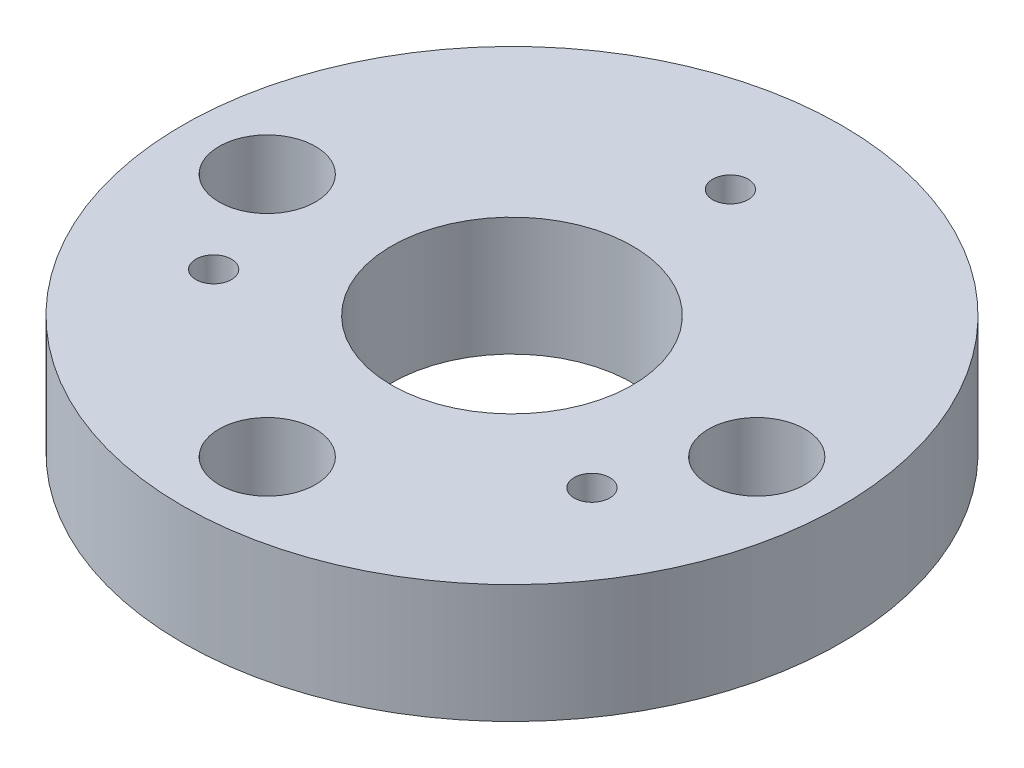
ISO-10303-21;
HEADER;
FILE_DESCRIPTION(('STEP AP214'),'2;1');
FILE_NAME('part.step','',(''),(''),'','','');
FILE_SCHEMA(('AUTOMOTIVE_DESIGN { 1 0 10303 214 1 1 1 1 }'));
ENDSEC;
DATA;
#1=APPLICATION_CONTEXT('core data for automotive mechanical design processes');
#2=APPLICATION_PROTOCOL_DEFINITION('international standard','automotive_design',2000,#1);
#3=PRODUCT_CONTEXT('',#1,'mechanical');
#4=PRODUCT('Part','Part','',(#3));
#5=PRODUCT_RELATED_PRODUCT_CATEGORY('part','',(#4));
#6=PRODUCT_DEFINITION_FORMATION('','',#4);
#7=PRODUCT_DEFINITION_CONTEXT('part definition',#1,'design');
#8=PRODUCT_DEFINITION('design','',#6,#7);
#9=PRODUCT_DEFINITION_SHAPE('','',#8);
#10=(LENGTH_UNIT() NAMED_UNIT(*) SI_UNIT(.MILLI.,.METRE.));
#11=(NAMED_UNIT(*) PLANE_ANGLE_UNIT() SI_UNIT($,.RADIAN.));
#12=(NAMED_UNIT(*) SI_UNIT($,.STERADIAN.) SOLID_ANGLE_UNIT());
#13=UNCERTAINTY_MEASURE_WITH_UNIT(LENGTH_MEASURE(1.E-05),#10,'distance_accuracy_value','');
#14=(GEOMETRIC_REPRESENTATION_CONTEXT(3) GLOBAL_UNCERTAINTY_ASSIGNED_CONTEXT((#13)) GLOBAL_UNIT_ASSIGNED_CONTEXT((#10,
#11,#12)) REPRESENTATION_CONTEXT('',''));
#15=CARTESIAN_POINT('',(0.,0.,0.));
#16=DIRECTION('',(0.,0.,1.));
#17=DIRECTION('',(1.,0.,0.));
#18=AXIS2_PLACEMENT_3D('',#15,#16,#17);
#19=CARTESIAN_POINT('',(20.6375,0.,0.));
#20=DIRECTION('',(0.,1.,0.));
#21=DIRECTION('',(0.,0.,1.));
#22=AXIS2_PLACEMENT_3D('',#19,#20,#21);
#23=CYLINDRICAL_SURFACE('',#22,1.83872486259726);
#24=CARTESIAN_POINT('',(20.6375,0.,0.));
#25=DIRECTION('',(0.,1.,0.));
#26=DIRECTION('',(0.,0.,1.));
#27=AXIS2_PLACEMENT_3D('',#24,#25,#26);
#28=CIRCLE('',#27,1.83872486259726);
#29=CARTESIAN_POINT('',(20.6375,0.,1.83872486259726));
#30=VERTEX_POINT('',#29);
#31=EDGE_CURVE('E80',#30,#30,#28,.T.);
#32=ORIENTED_EDGE('',*,*,#31,.F.);
#33=EDGE_LOOP('',(#32));
#34=FACE_BOUND('',#33,.T.);
#35=CARTESIAN_POINT('',(20.6375,4.,0.));
#36=DIRECTION('',(0.,1.,0.));
#37=DIRECTION('',(0.,0.,1.));
#38=AXIS2_PLACEMENT_3D('',#35,#36,#37);
#39=CIRCLE('',#38,1.83872486259726);
#40=CARTESIAN_POINT('',(20.6375,4.,1.83872486259726));
#41=VERTEX_POINT('',#40);
#42=EDGE_CURVE('E35',#41,#41,#39,.F.);
#43=ORIENTED_EDGE('',*,*,#42,.F.);
#44=EDGE_LOOP('',(#43));
#45=FACE_BOUND('',#44,.T.);
#46=ADVANCED_FACE('F31',(#34,#45),#23,.F.);
#47=CARTESIAN_POINT('',(0.,0.,20.6375));
#48=DIRECTION('',(0.,1.,0.));
#49=DIRECTION('',(0.,0.,1.));
#50=AXIS2_PLACEMENT_3D('',#47,#48,#49);
#51=CYLINDRICAL_SURFACE('',#50,1.83872486259726);
#52=CARTESIAN_POINT('',(0.,0.,20.6375));
#53=DIRECTION('',(0.,1.,0.));
#54=DIRECTION('',(0.,0.,1.));
#55=AXIS2_PLACEMENT_3D('',#52,#53,#54);
#56=CIRCLE('',#55,1.83872486259726);
#57=CARTESIAN_POINT('',(0.,0.,22.4762248625973));
#58=VERTEX_POINT('',#57);
#59=EDGE_CURVE('E77',#58,#58,#56,.T.);
#60=ORIENTED_EDGE('',*,*,#59,.F.);
#61=EDGE_LOOP('',(#60));
#62=FACE_BOUND('',#61,.T.);
#63=CARTESIAN_POINT('',(0.,4.,20.6375));
#64=DIRECTION('',(0.,1.,0.));
#65=DIRECTION('',(0.,0.,1.));
#66=AXIS2_PLACEMENT_3D('',#63,#64,#65);
#67=CIRCLE('',#66,1.83872486259726);
#68=CARTESIAN_POINT('',(0.,4.,22.4762248625973));
#69=VERTEX_POINT('',#68);
#70=EDGE_CURVE('E52',#69,#69,#67,.F.);
#71=ORIENTED_EDGE('',*,*,#70,.F.);
#72=EDGE_LOOP('',(#71));
#73=FACE_BOUND('',#72,.T.);
#74=ADVANCED_FACE('F157',(#62,#73),#51,.F.);
#75=CARTESIAN_POINT('',(-20.6375,0.,0.));
#76=DIRECTION('',(0.,1.,0.));
#77=DIRECTION('',(0.,0.,1.));
#78=AXIS2_PLACEMENT_3D('',#75,#76,#77);
#79=CYLINDRICAL_SURFACE('',#78,1.83872486259726);
#80=CARTESIAN_POINT('',(-20.6375,0.,0.));
#81=DIRECTION('',(0.,1.,0.));
#82=DIRECTION('',(0.,0.,1.));
#83=AXIS2_PLACEMENT_3D('',#80,#81,#82);
#84=CIRCLE('',#83,1.83872486259726);
#85=CARTESIAN_POINT('',(-20.6375,0.,1.83872486259726));
#86=VERTEX_POINT('',#85);
#87=EDGE_CURVE('E50',#86,#86,#84,.T.);
#88=ORIENTED_EDGE('',*,*,#87,.F.);
#89=EDGE_LOOP('',(#88));
#90=FACE_BOUND('',#89,.T.);
#91=CARTESIAN_POINT('',(-20.6375,4.,0.));
#92=DIRECTION('',(0.,1.,0.));
#93=DIRECTION('',(0.,0.,1.));
#94=AXIS2_PLACEMENT_3D('',#91,#92,#93);
#95=CIRCLE('',#94,1.83872486259726);
#96=CARTESIAN_POINT('',(-20.6375,4.,1.83872486259726));
#97=VERTEX_POINT('',#96);
#98=EDGE_CURVE('E48',#97,#97,#95,.F.);
#99=ORIENTED_EDGE('',*,*,#98,.F.);
#100=EDGE_LOOP('',(#99));
#101=FACE_BOUND('',#100,.T.);
#102=ADVANCED_FACE('F163',(#90,#101),#79,.F.);
#103=CARTESIAN_POINT('',(0.,10.,0.));
#104=DIRECTION('',(0.,1.,0.));
#105=DIRECTION('',(0.,0.,1.));
#106=AXIS2_PLACEMENT_3D('',#103,#104,#105);
#107=PLANE('',#106);
#108=CARTESIAN_POINT('',(0.,10.,20.6375));
#109=DIRECTION('',(0.,1.,0.));
#110=DIRECTION('',(0.,0.,1.));
#111=AXIS2_PLACEMENT_3D('',#108,#109,#110);
#112=CIRCLE('',#111,4.064);
#113=CARTESIAN_POINT('',(0.,10.,24.7015));
#114=VERTEX_POINT('',#113);
#115=EDGE_CURVE('E60',#114,#114,#112,.T.);
#116=ORIENTED_EDGE('',*,*,#115,.F.);
#117=EDGE_LOOP('',(#116));
#118=FACE_BOUND('',#117,.T.);
#119=CARTESIAN_POINT('',(20.6375,10.,0.));
#120=DIRECTION('',(0.,1.,0.));
#121=DIRECTION('',(0.,0.,1.));
#122=AXIS2_PLACEMENT_3D('',#119,#120,#121);
#123=CIRCLE('',#122,4.064);
#124=CARTESIAN_POINT('',(20.6375,10.,4.064));
#125=VERTEX_POINT('',#124);
#126=EDGE_CURVE('E70',#125,#125,#123,.T.);
#127=ORIENTED_EDGE('',*,*,#126,.F.);
#128=EDGE_LOOP('',(#127));
#129=FACE_BOUND('',#128,.T.);
#130=CARTESIAN_POINT('',(-20.6375,10.,0.));
#131=DIRECTION('',(0.,1.,0.));
#132=DIRECTION('',(0.,0.,1.));
#133=AXIS2_PLACEMENT_3D('',#130,#131,#132);
#134=CIRCLE('',#133,4.064);
#135=CARTESIAN_POINT('',(-20.6375,10.,4.064));
#136=VERTEX_POINT('',#135);
#137=EDGE_CURVE('E58',#136,#136,#134,.T.);
#138=ORIENTED_EDGE('',*,*,#137,.F.);
#139=EDGE_LOOP('',(#138));
#140=FACE_BOUND('',#139,.T.);
#141=CARTESIAN_POINT('',(15.9478578106922,10.,9.20750000000042));
#142=DIRECTION('',(0.,1.,0.));
#143=DIRECTION('',(0.,0.,1.));
#144=AXIS2_PLACEMENT_3D('',#141,#142,#143);
#145=CIRCLE('',#144,1.5);
#146=CARTESIAN_POINT('',(15.9478578106922,10.,10.7075000000004));
#147=VERTEX_POINT('',#146);
#148=EDGE_CURVE('E86',#147,#147,#145,.T.);
#149=ORIENTED_EDGE('',*,*,#148,.F.);
#150=EDGE_LOOP('',(#149));
#151=FACE_BOUND('',#150,.T.);
#152=CARTESIAN_POINT('',(-15.9478578106887,10.,9.20749999999958));
#153=DIRECTION('',(0.,1.,0.));
#154=DIRECTION('',(0.,0.,1.));
#155=AXIS2_PLACEMENT_3D('',#152,#153,#154);
#156=CIRCLE('',#155,1.5);
#157=CARTESIAN_POINT('',(-15.9478578106887,10.,10.7074999999996));
#158=VERTEX_POINT('',#157);
#159=EDGE_CURVE('E85',#158,#158,#156,.T.);
#160=ORIENTED_EDGE('',*,*,#159,.F.);
#161=EDGE_LOOP('',(#160));
#162=FACE_BOUND('',#161,.T.);
#163=CARTESIAN_POINT('',(2.51206143219242E-12,10.,-18.415));
#164=DIRECTION('',(0.,1.,0.));
#165=DIRECTION('',(0.,0.,1.));
#166=AXIS2_PLACEMENT_3D('',#163,#164,#165);
#167=CIRCLE('',#166,1.5);
#168=CARTESIAN_POINT('',(2.51206143219242E-12,10.,-16.915));
#169=VERTEX_POINT('',#168);
#170=EDGE_CURVE('E89',#169,#169,#167,.T.);
#171=ORIENTED_EDGE('',*,*,#170,.F.);
#172=EDGE_LOOP('',(#171));
#173=FACE_BOUND('',#172,.T.);
#174=CARTESIAN_POINT('',(0.,10.,0.));
#175=DIRECTION('',(0.,1.,0.));
#176=DIRECTION('',(0.,0.,1.));
#177=AXIS2_PLACEMENT_3D('',#174,#175,#176);
#178=CIRCLE('',#177,27.7876);
#179=CARTESIAN_POINT('',(0.,10.,27.7876));
#180=VERTEX_POINT('',#179);
#181=EDGE_CURVE('E101',#180,#180,#178,.T.);
#182=ORIENTED_EDGE('',*,*,#181,.T.);
#183=EDGE_LOOP('',(#182));
#184=FACE_BOUND('',#183,.T.);
#185=CARTESIAN_POINT('',(0.,10.,0.));
#186=DIRECTION('',(0.,1.,0.));
#187=DIRECTION('',(0.,0.,1.));
#188=AXIS2_PLACEMENT_3D('',#185,#186,#187);
#189=CIRCLE('',#188,10.16);
#190=CARTESIAN_POINT('',(0.,10.,10.16));
#191=VERTEX_POINT('',#190);
#192=EDGE_CURVE('E95',#191,#191,#189,.T.);
#193=ORIENTED_EDGE('',*,*,#192,.F.);
#194=EDGE_LOOP('',(#193));
#195=FACE_BOUND('',#194,.T.);
#196=ADVANCED_FACE('F132',(#118,#129,#140,#151,#162,#173,#184,#195),#107,.T.);
#197=CARTESIAN_POINT('',(0.,0.,0.));
#198=DIRECTION('',(0.,1.,0.));
#199=DIRECTION('',(0.,0.,1.));
#200=AXIS2_PLACEMENT_3D('',#197,#198,#199);
#201=PLANE('',#200);
#202=ORIENTED_EDGE('',*,*,#59,.T.);
#203=EDGE_LOOP('',(#202));
#204=FACE_BOUND('',#203,.T.);
#205=ORIENTED_EDGE('',*,*,#87,.T.);
#206=EDGE_LOOP('',(#205));
#207=FACE_BOUND('',#206,.T.);
#208=ORIENTED_EDGE('',*,*,#31,.T.);
#209=EDGE_LOOP('',(#208));
#210=FACE_BOUND('',#209,.T.);
#211=CARTESIAN_POINT('',(-15.9478578106887,0.,9.20749999999958));
#212=DIRECTION('',(0.,1.,0.));
#213=DIRECTION('',(0.,0.,1.));
#214=AXIS2_PLACEMENT_3D('',#211,#212,#213);
#215=CIRCLE('',#214,3.89999999999998);
#216=CARTESIAN_POINT('',(-15.9478578106887,0.,13.1074999999996));
#217=VERTEX_POINT('',#216);
#218=EDGE_CURVE('E112',#217,#217,#215,.T.);
#219=ORIENTED_EDGE('',*,*,#218,.T.);
#220=EDGE_LOOP('',(#219));
#221=FACE_BOUND('',#220,.T.);
#222=CARTESIAN_POINT('',(15.9478578106922,0.,9.20750000000042));
#223=DIRECTION('',(0.,1.,0.));
#224=DIRECTION('',(0.,0.,1.));
#225=AXIS2_PLACEMENT_3D('',#222,#223,#224);
#226=CIRCLE('',#225,3.9);
#227=CARTESIAN_POINT('',(15.9478578106922,0.,13.1075000000004));
#228=VERTEX_POINT('',#227);
#229=EDGE_CURVE('E109',#228,#228,#226,.T.);
#230=ORIENTED_EDGE('',*,*,#229,.T.);
#231=EDGE_LOOP('',(#230));
#232=FACE_BOUND('',#231,.T.);
#233=CARTESIAN_POINT('',(2.51206143219242E-12,0.,-18.415));
#234=DIRECTION('',(0.,1.,0.));
#235=DIRECTION('',(0.,0.,1.));
#236=AXIS2_PLACEMENT_3D('',#233,#234,#235);
#237=CIRCLE('',#236,3.9);
#238=CARTESIAN_POINT('',(2.51206143219242E-12,0.,-14.515));
#239=VERTEX_POINT('',#238);
#240=EDGE_CURVE('E104',#239,#239,#237,.T.);
#241=ORIENTED_EDGE('',*,*,#240,.T.);
#242=EDGE_LOOP('',(#241));
#243=FACE_BOUND('',#242,.T.);
#244=CARTESIAN_POINT('',(0.,0.,0.));
#245=DIRECTION('',(0.,1.,0.));
#246=DIRECTION('',(0.,0.,1.));
#247=AXIS2_PLACEMENT_3D('',#244,#245,#246);
#248=CIRCLE('',#247,27.7876);
#249=CARTESIAN_POINT('',(0.,0.,27.7876));
#250=VERTEX_POINT('',#249);
#251=EDGE_CURVE('E98',#250,#250,#248,.T.);
#252=ORIENTED_EDGE('',*,*,#251,.F.);
#253=EDGE_LOOP('',(#252));
#254=FACE_BOUND('',#253,.T.);
#255=CARTESIAN_POINT('',(0.,0.,0.));
#256=DIRECTION('',(0.,1.,0.));
#257=DIRECTION('',(0.,0.,1.));
#258=AXIS2_PLACEMENT_3D('',#255,#256,#257);
#259=CIRCLE('',#258,10.16);
#260=CARTESIAN_POINT('',(0.,0.,10.16));
#261=VERTEX_POINT('',#260);
#262=EDGE_CURVE('E94',#261,#261,#259,.T.);
#263=ORIENTED_EDGE('',*,*,#262,.T.);
#264=EDGE_LOOP('',(#263));
#265=FACE_BOUND('',#264,.T.);
#266=ADVANCED_FACE('F128',(#204,#207,#210,#221,#232,#243,#254,#265),#201,.F.);
#267=CARTESIAN_POINT('',(0.,10.,0.));
#268=DIRECTION('',(0.,-1.,0.));
#269=DIRECTION('',(0.,0.,-1.));
#270=AXIS2_PLACEMENT_3D('',#267,#268,#269);
#271=CYLINDRICAL_SURFACE('',#270,27.7876);
#272=ORIENTED_EDGE('',*,*,#181,.F.);
#273=EDGE_LOOP('',(#272));
#274=FACE_BOUND('',#273,.T.);
#275=ORIENTED_EDGE('',*,*,#251,.T.);
#276=EDGE_LOOP('',(#275));
#277=FACE_BOUND('',#276,.T.);
#278=ADVANCED_FACE('F131',(#274,#277),#271,.T.);
#279=CARTESIAN_POINT('',(0.,10.,0.));
#280=DIRECTION('',(0.,-1.,0.));
#281=DIRECTION('',(0.,0.,-1.));
#282=AXIS2_PLACEMENT_3D('',#279,#280,#281);
#283=CYLINDRICAL_SURFACE('',#282,10.16);
#284=ORIENTED_EDGE('',*,*,#192,.T.);
#285=EDGE_LOOP('',(#284));
#286=FACE_BOUND('',#285,.T.);
#287=ORIENTED_EDGE('',*,*,#262,.F.);
#288=EDGE_LOOP('',(#287));
#289=FACE_BOUND('',#288,.T.);
#290=ADVANCED_FACE('F143',(#286,#289),#283,.F.);
#291=CARTESIAN_POINT('',(2.51206143219242E-12,0.,-18.415));
#292=DIRECTION('',(0.,1.,0.));
#293=DIRECTION('',(0.,0.,1.));
#294=AXIS2_PLACEMENT_3D('',#291,#292,#293);
#295=CYLINDRICAL_SURFACE('',#294,1.5);
#296=CARTESIAN_POINT('',(2.51206143219242E-12,2.40000000000001,-18.415));
#297=DIRECTION('',(0.,1.,0.));
#298=DIRECTION('',(0.,0.,1.));
#299=AXIS2_PLACEMENT_3D('',#296,#297,#298);
#300=CIRCLE('',#299,1.5);
#301=CARTESIAN_POINT('',(2.51206143219242E-12,2.40000000000001,-16.915));
#302=VERTEX_POINT('',#301);
#303=EDGE_CURVE('E10',#302,#302,#300,.F.);
#304=ORIENTED_EDGE('',*,*,#303,.T.);
#305=EDGE_LOOP('',(#304));
#306=FACE_BOUND('',#305,.T.);
#307=ORIENTED_EDGE('',*,*,#170,.T.);
#308=EDGE_LOOP('',(#307));
#309=FACE_BOUND('',#308,.T.);
#310=ADVANCED_FACE('F145',(#306,#309),#295,.F.);
#311=CARTESIAN_POINT('',(-15.9478578106887,0.,9.20749999999958));
#312=DIRECTION('',(0.,1.,0.));
#313=DIRECTION('',(0.,0.,1.));
#314=AXIS2_PLACEMENT_3D('',#311,#312,#313);
#315=CYLINDRICAL_SURFACE('',#314,1.5);
#316=CARTESIAN_POINT('',(-15.9478578106887,2.39999999999999,9.20749999999958));
#317=DIRECTION('',(0.,1.,0.));
#318=DIRECTION('',(0.,0.,1.));
#319=AXIS2_PLACEMENT_3D('',#316,#317,#318);
#320=CIRCLE('',#319,1.5);
#321=CARTESIAN_POINT('',(-15.9478578106887,2.39999999999999,10.7074999999996));
#322=VERTEX_POINT('',#321);
#323=EDGE_CURVE('E44',#322,#322,#320,.F.);
#324=ORIENTED_EDGE('',*,*,#323,.T.);
#325=EDGE_LOOP('',(#324));
#326=FACE_BOUND('',#325,.T.);
#327=ORIENTED_EDGE('',*,*,#159,.T.);
#328=EDGE_LOOP('',(#327));
#329=FACE_BOUND('',#328,.T.);
#330=ADVANCED_FACE('F117',(#326,#329),#315,.F.);
#331=CARTESIAN_POINT('',(15.9478578106922,0.,9.20750000000042));
#332=DIRECTION('',(0.,1.,0.));
#333=DIRECTION('',(0.,0.,1.));
#334=AXIS2_PLACEMENT_3D('',#331,#332,#333);
#335=CYLINDRICAL_SURFACE('',#334,1.5);
#336=CARTESIAN_POINT('',(15.9478578106922,2.40000000000001,9.20750000000042));
#337=DIRECTION('',(0.,1.,0.));
#338=DIRECTION('',(0.,0.,1.));
#339=AXIS2_PLACEMENT_3D('',#336,#337,#338);
#340=CIRCLE('',#339,1.5);
#341=CARTESIAN_POINT('',(15.9478578106922,2.40000000000001,10.7075000000004));
#342=VERTEX_POINT('',#341);
#343=EDGE_CURVE('E39',#342,#342,#340,.F.);
#344=ORIENTED_EDGE('',*,*,#343,.T.);
#345=EDGE_LOOP('',(#344));
#346=FACE_BOUND('',#345,.T.);
#347=ORIENTED_EDGE('',*,*,#148,.T.);
#348=EDGE_LOOP('',(#347));
#349=FACE_BOUND('',#348,.T.);
#350=ADVANCED_FACE('F124',(#346,#349),#335,.F.);
#351=CARTESIAN_POINT('',(-15.9478578106887,0.,9.20749999999958));
#352=DIRECTION('',(0.,-1.,0.));
#353=DIRECTION('',(0.,0.,-1.));
#354=AXIS2_PLACEMENT_3D('',#351,#352,#353);
#355=CONICAL_SURFACE('',#354,3.89999999999998,0.785398163397447);
#356=ORIENTED_EDGE('',*,*,#323,.F.);
#357=EDGE_LOOP('',(#356));
#358=FACE_BOUND('',#357,.T.);
#359=ORIENTED_EDGE('',*,*,#218,.F.);
#360=EDGE_LOOP('',(#359));
#361=FACE_BOUND('',#360,.T.);
#362=ADVANCED_FACE('F120',(#358,#361),#355,.F.);
#363=CARTESIAN_POINT('',(15.9478578106922,0.,9.20750000000042));
#364=DIRECTION('',(0.,-1.,0.));
#365=DIRECTION('',(0.,0.,-1.));
#366=AXIS2_PLACEMENT_3D('',#363,#364,#365);
#367=CONICAL_SURFACE('',#366,3.9,0.785398163397447);
#368=ORIENTED_EDGE('',*,*,#343,.F.);
#369=EDGE_LOOP('',(#368));
#370=FACE_BOUND('',#369,.T.);
#371=ORIENTED_EDGE('',*,*,#229,.F.);
#372=EDGE_LOOP('',(#371));
#373=FACE_BOUND('',#372,.T.);
#374=ADVANCED_FACE('F123',(#370,#373),#367,.F.);
#375=CARTESIAN_POINT('',(2.51206143219242E-12,0.,-18.415));
#376=DIRECTION('',(0.,-1.,0.));
#377=DIRECTION('',(0.,0.,-1.));
#378=AXIS2_PLACEMENT_3D('',#375,#376,#377);
#379=CONICAL_SURFACE('',#378,3.9,0.785398163397446);
#380=ORIENTED_EDGE('',*,*,#303,.F.);
#381=EDGE_LOOP('',(#380));
#382=FACE_BOUND('',#381,.T.);
#383=ORIENTED_EDGE('',*,*,#240,.F.);
#384=EDGE_LOOP('',(#383));
#385=FACE_BOUND('',#384,.T.);
#386=ADVANCED_FACE('F33',(#382,#385),#379,.F.);
#387=CARTESIAN_POINT('',(-20.6375,4.,0.));
#388=DIRECTION('',(0.,1.,0.));
#389=DIRECTION('',(0.,0.,1.));
#390=AXIS2_PLACEMENT_3D('',#387,#388,#389);
#391=PLANE('',#390);
#392=CARTESIAN_POINT('',(-20.6375,4.,0.));
#393=DIRECTION('',(0.,1.,0.));
#394=DIRECTION('',(0.,0.,1.));
#395=AXIS2_PLACEMENT_3D('',#392,#393,#394);
#396=CIRCLE('',#395,4.064);
#397=CARTESIAN_POINT('',(-20.6375,4.,4.064));
#398=VERTEX_POINT('',#397);
#399=EDGE_CURVE('E51',#398,#398,#396,.T.);
#400=ORIENTED_EDGE('',*,*,#399,.T.);
#401=EDGE_LOOP('',(#400));
#402=FACE_BOUND('',#401,.T.);
#403=ORIENTED_EDGE('',*,*,#98,.T.);
#404=EDGE_LOOP('',(#403));
#405=FACE_BOUND('',#404,.T.);
#406=ADVANCED_FACE('F198',(#402,#405),#391,.T.);
#407=CARTESIAN_POINT('',(-20.6375,4.,0.));
#408=DIRECTION('',(0.,1.,0.));
#409=DIRECTION('',(0.,0.,1.));
#410=AXIS2_PLACEMENT_3D('',#407,#408,#409);
#411=CYLINDRICAL_SURFACE('',#410,4.064);
#412=ORIENTED_EDGE('',*,*,#399,.F.);
#413=EDGE_LOOP('',(#412));
#414=FACE_BOUND('',#413,.T.);
#415=ORIENTED_EDGE('',*,*,#137,.T.);
#416=EDGE_LOOP('',(#415));
#417=FACE_BOUND('',#416,.T.);
#418=ADVANCED_FACE('F206',(#414,#417),#411,.F.);
#419=CARTESIAN_POINT('',(0.,4.,20.6375));
#420=DIRECTION('',(0.,1.,0.));
#421=DIRECTION('',(0.,0.,1.));
#422=AXIS2_PLACEMENT_3D('',#419,#420,#421);
#423=PLANE('',#422);
#424=CARTESIAN_POINT('',(0.,4.,20.6375));
#425=DIRECTION('',(0.,1.,0.));
#426=DIRECTION('',(0.,0.,1.));
#427=AXIS2_PLACEMENT_3D('',#424,#425,#426);
#428=CIRCLE('',#427,4.064);
#429=CARTESIAN_POINT('',(0.,4.,24.7015));
#430=VERTEX_POINT('',#429);
#431=EDGE_CURVE('E54',#430,#430,#428,.T.);
#432=ORIENTED_EDGE('',*,*,#431,.T.);
#433=EDGE_LOOP('',(#432));
#434=FACE_BOUND('',#433,.T.);
#435=ORIENTED_EDGE('',*,*,#70,.T.);
#436=EDGE_LOOP('',(#435));
#437=FACE_BOUND('',#436,.T.);
#438=ADVANCED_FACE('F215',(#434,#437),#423,.T.);
#439=CARTESIAN_POINT('',(0.,4.,20.6375));
#440=DIRECTION('',(0.,1.,0.));
#441=DIRECTION('',(0.,0.,1.));
#442=AXIS2_PLACEMENT_3D('',#439,#440,#441);
#443=CYLINDRICAL_SURFACE('',#442,4.064);
#444=ORIENTED_EDGE('',*,*,#431,.F.);
#445=EDGE_LOOP('',(#444));
#446=FACE_BOUND('',#445,.T.);
#447=ORIENTED_EDGE('',*,*,#115,.T.);
#448=EDGE_LOOP('',(#447));
#449=FACE_BOUND('',#448,.T.);
#450=ADVANCED_FACE('F223',(#446,#449),#443,.F.);
#451=CARTESIAN_POINT('',(20.6375,4.,0.));
#452=DIRECTION('',(0.,1.,0.));
#453=DIRECTION('',(0.,0.,1.));
#454=AXIS2_PLACEMENT_3D('',#451,#452,#453);
#455=PLANE('',#454);
#456=CARTESIAN_POINT('',(20.6375,4.,0.));
#457=DIRECTION('',(0.,1.,0.));
#458=DIRECTION('',(0.,0.,1.));
#459=AXIS2_PLACEMENT_3D('',#456,#457,#458);
#460=CIRCLE('',#459,4.064);
#461=CARTESIAN_POINT('',(20.6375,4.,4.064));
#462=VERTEX_POINT('',#461);
#463=EDGE_CURVE('E65',#462,#462,#460,.T.);
#464=ORIENTED_EDGE('',*,*,#463,.T.);
#465=EDGE_LOOP('',(#464));
#466=FACE_BOUND('',#465,.T.);
#467=ORIENTED_EDGE('',*,*,#42,.T.);
#468=EDGE_LOOP('',(#467));
#469=FACE_BOUND('',#468,.T.);
#470=ADVANCED_FACE('F230',(#466,#469),#455,.T.);
#471=CARTESIAN_POINT('',(20.6375,4.,0.));
#472=DIRECTION('',(0.,1.,0.));
#473=DIRECTION('',(0.,0.,1.));
#474=AXIS2_PLACEMENT_3D('',#471,#472,#473);
#475=CYLINDRICAL_SURFACE('',#474,4.064);
#476=ORIENTED_EDGE('',*,*,#463,.F.);
#477=EDGE_LOOP('',(#476));
#478=FACE_BOUND('',#477,.T.);
#479=ORIENTED_EDGE('',*,*,#126,.T.);
#480=EDGE_LOOP('',(#479));
#481=FACE_BOUND('',#480,.T.);
#482=ADVANCED_FACE('F238',(#478,#481),#475,.F.);
#483=CLOSED_SHELL('',(#46,#74,#102,#196,#266,#278,#290,#310,#330,#350,#362,#374,#386,#406,#418,
#438,#450,#470,#482));
#484=MANIFOLD_SOLID_BREP('B2',#483);
#485=ADVANCED_BREP_SHAPE_REPRESENTATION('',(#18,#484),#14);
#486=SHAPE_DEFINITION_REPRESENTATION(#9,#485);
ENDSEC;
END-ISO-10303-21;
